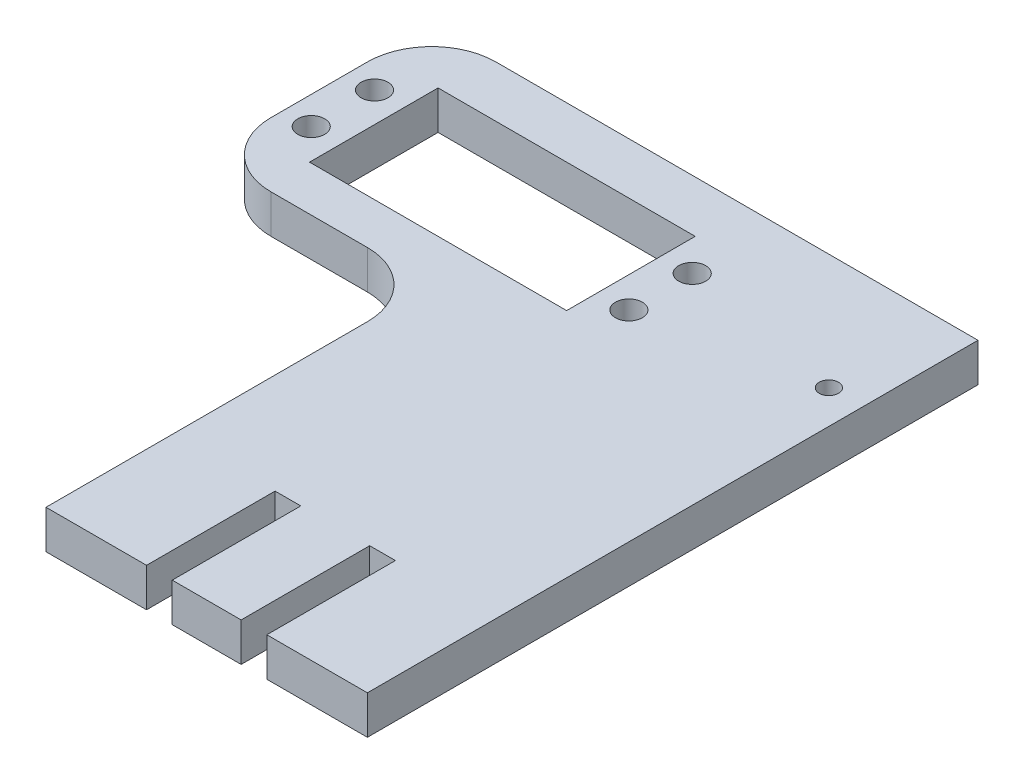
ISO-10303-21;
HEADER;
FILE_DESCRIPTION(('STEP AP214'),'2;1');
FILE_NAME('part.step','',(''),(''),'','','');
FILE_SCHEMA(('AUTOMOTIVE_DESIGN { 1 0 10303 214 1 1 1 1 }'));
ENDSEC;
DATA;
#1=APPLICATION_CONTEXT('core data for automotive mechanical design processes');
#2=APPLICATION_PROTOCOL_DEFINITION('international standard','automotive_design',2000,#1);
#3=PRODUCT_CONTEXT('',#1,'mechanical');
#4=PRODUCT('Part','Part','',(#3));
#5=PRODUCT_RELATED_PRODUCT_CATEGORY('part','',(#4));
#6=PRODUCT_DEFINITION_FORMATION('','',#4);
#7=PRODUCT_DEFINITION_CONTEXT('part definition',#1,'design');
#8=PRODUCT_DEFINITION('design','',#6,#7);
#9=PRODUCT_DEFINITION_SHAPE('','',#8);
#10=(LENGTH_UNIT() NAMED_UNIT(*) SI_UNIT(.MILLI.,.METRE.));
#11=(NAMED_UNIT(*) PLANE_ANGLE_UNIT() SI_UNIT($,.RADIAN.));
#12=(NAMED_UNIT(*) SI_UNIT($,.STERADIAN.) SOLID_ANGLE_UNIT());
#13=UNCERTAINTY_MEASURE_WITH_UNIT(LENGTH_MEASURE(1.E-05),#10,'distance_accuracy_value','');
#14=(GEOMETRIC_REPRESENTATION_CONTEXT(3) GLOBAL_UNCERTAINTY_ASSIGNED_CONTEXT((#13)) GLOBAL_UNIT_ASSIGNED_CONTEXT((#10,
#11,#12)) REPRESENTATION_CONTEXT('',''));
#15=CARTESIAN_POINT('',(0.,0.,0.));
#16=DIRECTION('',(0.,0.,1.));
#17=DIRECTION('',(1.,0.,0.));
#18=AXIS2_PLACEMENT_3D('',#15,#16,#17);
#19=CARTESIAN_POINT('',(0.,6.,47.5));
#20=DIRECTION('',(0.,0.,-1.));
#21=DIRECTION('',(-1.,0.,0.));
#22=AXIS2_PLACEMENT_3D('',#19,#20,#21);
#23=PLANE('',#22);
#24=DIRECTION('',(1.,0.,0.));
#25=VECTOR('',#24,1.);
#26=CARTESIAN_POINT('',(0.,0.,47.5));
#27=LINE('',#26,#25);
#28=CARTESIAN_POINT('',(-25.,0.,47.5));
#29=VERTEX_POINT('',#28);
#30=CARTESIAN_POINT('',(-9.36,0.,47.5));
#31=VERTEX_POINT('',#30);
#32=EDGE_CURVE('E283',#29,#31,#27,.T.);
#33=ORIENTED_EDGE('',*,*,#32,.T.);
#34=DIRECTION('',(0.,1.,0.));
#35=VECTOR('',#34,1.);
#36=CARTESIAN_POINT('',(-9.36,-3.99999999999999,47.5));
#37=LINE('',#36,#35);
#38=CARTESIAN_POINT('',(-9.36,6.,47.5));
#39=VERTEX_POINT('',#38);
#40=EDGE_CURVE('E229',#31,#39,#37,.T.);
#41=ORIENTED_EDGE('',*,*,#40,.T.);
#42=DIRECTION('',(1.,0.,0.));
#43=VECTOR('',#42,1.);
#44=CARTESIAN_POINT('',(0.,6.,47.5));
#45=LINE('',#44,#43);
#46=CARTESIAN_POINT('',(-25.,6.,47.5));
#47=VERTEX_POINT('',#46);
#48=EDGE_CURVE('E264',#47,#39,#45,.T.);
#49=ORIENTED_EDGE('',*,*,#48,.F.);
#50=DIRECTION('',(0.,-1.,0.));
#51=VECTOR('',#50,1.);
#52=CARTESIAN_POINT('',(-25.,6.,47.5));
#53=LINE('',#52,#51);
#54=EDGE_CURVE('E296',#47,#29,#53,.T.);
#55=ORIENTED_EDGE('',*,*,#54,.T.);
#56=EDGE_LOOP('',(#33,#41,#49,#55));
#57=FACE_BOUND('',#56,.T.);
#58=ADVANCED_FACE('F35',(#57),#23,.F.);
#59=CARTESIAN_POINT('',(9.36,6.,47.5));
#60=VERTEX_POINT('',#59);
#61=CARTESIAN_POINT('',(25.,6.,47.5));
#62=VERTEX_POINT('',#61);
#63=EDGE_CURVE('E263',#60,#62,#45,.T.);
#64=ORIENTED_EDGE('',*,*,#63,.F.);
#65=DIRECTION('',(0.,1.,0.));
#66=VECTOR('',#65,1.);
#67=CARTESIAN_POINT('',(9.36,-3.99999999999999,47.5));
#68=LINE('',#67,#66);
#69=CARTESIAN_POINT('',(9.36,0.,47.5));
#70=VERTEX_POINT('',#69);
#71=EDGE_CURVE('E247',#70,#60,#68,.T.);
#72=ORIENTED_EDGE('',*,*,#71,.F.);
#73=CARTESIAN_POINT('',(25.,0.,47.5));
#74=VERTEX_POINT('',#73);
#75=EDGE_CURVE('E282',#70,#74,#27,.T.);
#76=ORIENTED_EDGE('',*,*,#75,.T.);
#77=DIRECTION('',(0.,-1.,0.));
#78=VECTOR('',#77,1.);
#79=CARTESIAN_POINT('',(25.,6.,47.5));
#80=LINE('',#79,#78);
#81=EDGE_CURVE('E293',#62,#74,#80,.T.);
#82=ORIENTED_EDGE('',*,*,#81,.F.);
#83=EDGE_LOOP('',(#64,#72,#76,#82));
#84=FACE_BOUND('',#83,.T.);
#85=ADVANCED_FACE('F407',(#84),#23,.F.);
#86=CARTESIAN_POINT('',(-60.,6.,0.));
#87=DIRECTION('',(1.,0.,0.));
#88=DIRECTION('',(0.,0.,-1.));
#89=AXIS2_PLACEMENT_3D('',#86,#87,#88);
#90=PLANE('',#89);
#91=DIRECTION('',(0.,0.,1.));
#92=VECTOR('',#91,1.);
#93=CARTESIAN_POINT('',(-60.,6.,0.));
#94=LINE('',#93,#92);
#95=CARTESIAN_POINT('',(-60.,6.,-37.5));
#96=VERTEX_POINT('',#95);
#97=CARTESIAN_POINT('',(-60.,6.,-22.5));
#98=VERTEX_POINT('',#97);
#99=EDGE_CURVE('E253',#96,#98,#94,.T.);
#100=ORIENTED_EDGE('',*,*,#99,.F.);
#101=DIRECTION('',(0.,-1.,0.));
#102=VECTOR('',#101,1.);
#103=CARTESIAN_POINT('',(-60.,6.,-37.5));
#104=LINE('',#103,#102);
#105=CARTESIAN_POINT('',(-60.,0.,-37.5));
#106=VERTEX_POINT('',#105);
#107=EDGE_CURVE('E300',#96,#106,#104,.T.);
#108=ORIENTED_EDGE('',*,*,#107,.T.);
#109=DIRECTION('',(0.,0.,1.));
#110=VECTOR('',#109,1.);
#111=CARTESIAN_POINT('',(-60.,0.,0.));
#112=LINE('',#111,#110);
#113=CARTESIAN_POINT('',(-60.,0.,-22.5));
#114=VERTEX_POINT('',#113);
#115=EDGE_CURVE('E232',#106,#114,#112,.T.);
#116=ORIENTED_EDGE('',*,*,#115,.T.);
#117=DIRECTION('',(0.,-1.,0.));
#118=VECTOR('',#117,1.);
#119=CARTESIAN_POINT('',(-60.,6.,-22.5));
#120=LINE('',#119,#118);
#121=EDGE_CURVE('E298',#114,#98,#120,.F.);
#122=ORIENTED_EDGE('',*,*,#121,.T.);
#123=EDGE_LOOP('',(#100,#108,#116,#122));
#124=FACE_BOUND('',#123,.T.);
#125=ADVANCED_FACE('F371',(#124),#90,.F.);
#126=CARTESIAN_POINT('',(0.,6.,-12.5));
#127=DIRECTION('',(0.,0.,-1.));
#128=DIRECTION('',(-1.,0.,0.));
#129=AXIS2_PLACEMENT_3D('',#126,#127,#128);
#130=PLANE('',#129);
#131=DIRECTION('',(1.,0.,0.));
#132=VECTOR('',#131,1.);
#133=CARTESIAN_POINT('',(0.,6.,-12.5));
#134=LINE('',#133,#132);
#135=CARTESIAN_POINT('',(-50.,6.,-12.5));
#136=VERTEX_POINT('',#135);
#137=CARTESIAN_POINT('',(-35.,6.,-12.5));
#138=VERTEX_POINT('',#137);
#139=EDGE_CURVE('E256',#136,#138,#134,.T.);
#140=ORIENTED_EDGE('',*,*,#139,.F.);
#141=DIRECTION('',(0.,-1.,0.));
#142=VECTOR('',#141,1.);
#143=CARTESIAN_POINT('',(-50.,6.,-12.5));
#144=LINE('',#143,#142);
#145=CARTESIAN_POINT('',(-50.,0.,-12.5));
#146=VERTEX_POINT('',#145);
#147=EDGE_CURVE('E315',#136,#146,#144,.T.);
#148=ORIENTED_EDGE('',*,*,#147,.T.);
#149=DIRECTION('',(1.,0.,0.));
#150=VECTOR('',#149,1.);
#151=CARTESIAN_POINT('',(0.,0.,-12.5));
#152=LINE('',#151,#150);
#153=CARTESIAN_POINT('',(-35.,0.,-12.5));
#154=VERTEX_POINT('',#153);
#155=EDGE_CURVE('E276',#146,#154,#152,.T.);
#156=ORIENTED_EDGE('',*,*,#155,.T.);
#157=DIRECTION('',(0.,-1.,0.));
#158=VECTOR('',#157,1.);
#159=CARTESIAN_POINT('',(-35.,6.,-12.5));
#160=LINE('',#159,#158);
#161=EDGE_CURVE('E313',#154,#138,#160,.F.);
#162=ORIENTED_EDGE('',*,*,#161,.T.);
#163=EDGE_LOOP('',(#140,#148,#156,#162));
#164=FACE_BOUND('',#163,.T.);
#165=ADVANCED_FACE('F362',(#164),#130,.F.);
#166=CARTESIAN_POINT('',(-25.,6.,0.));
#167=DIRECTION('',(-1.,0.,0.));
#168=DIRECTION('',(0.,0.,1.));
#169=AXIS2_PLACEMENT_3D('',#166,#167,#168);
#170=PLANE('',#169);
#171=DIRECTION('',(0.,0.,-1.));
#172=VECTOR('',#171,1.);
#173=CARTESIAN_POINT('',(-25.,6.,0.));
#174=LINE('',#173,#172);
#175=CARTESIAN_POINT('',(-25.,6.,-2.50000000000001));
#176=VERTEX_POINT('',#175);
#177=EDGE_CURVE('E260',#47,#176,#174,.T.);
#178=ORIENTED_EDGE('',*,*,#177,.T.);
#179=DIRECTION('',(0.,-1.,0.));
#180=VECTOR('',#179,1.);
#181=CARTESIAN_POINT('',(-25.,6.,-2.50000000000001));
#182=LINE('',#181,#180);
#183=CARTESIAN_POINT('',(-25.,0.,-2.50000000000001));
#184=VERTEX_POINT('',#183);
#185=EDGE_CURVE('E318',#176,#184,#182,.T.);
#186=ORIENTED_EDGE('',*,*,#185,.T.);
#187=DIRECTION('',(0.,0.,-1.));
#188=VECTOR('',#187,1.);
#189=CARTESIAN_POINT('',(-25.,0.,0.));
#190=LINE('',#189,#188);
#191=EDGE_CURVE('E279',#29,#184,#190,.T.);
#192=ORIENTED_EDGE('',*,*,#191,.F.);
#193=ORIENTED_EDGE('',*,*,#54,.F.);
#194=EDGE_LOOP('',(#178,#186,#192,#193));
#195=FACE_BOUND('',#194,.T.);
#196=ADVANCED_FACE('F355',(#195),#170,.T.);
#197=CARTESIAN_POINT('',(-5.36,6.,47.5));
#198=VERTEX_POINT('',#197);
#199=CARTESIAN_POINT('',(5.36,6.,47.5));
#200=VERTEX_POINT('',#199);
#201=EDGE_CURVE('E268',#198,#200,#45,.T.);
#202=ORIENTED_EDGE('',*,*,#201,.F.);
#203=DIRECTION('',(0.,1.,0.));
#204=VECTOR('',#203,1.);
#205=CARTESIAN_POINT('',(-5.36,-3.99999999999999,47.5));
#206=LINE('',#205,#204);
#207=CARTESIAN_POINT('',(-5.36,0.,47.5));
#208=VERTEX_POINT('',#207);
#209=EDGE_CURVE('E228',#208,#198,#206,.T.);
#210=ORIENTED_EDGE('',*,*,#209,.F.);
#211=CARTESIAN_POINT('',(5.36,0.,47.5));
#212=VERTEX_POINT('',#211);
#213=EDGE_CURVE('E287',#208,#212,#27,.T.);
#214=ORIENTED_EDGE('',*,*,#213,.T.);
#215=DIRECTION('',(0.,1.,0.));
#216=VECTOR('',#215,1.);
#217=CARTESIAN_POINT('',(5.36,-3.99999999999999,47.5));
#218=LINE('',#217,#216);
#219=EDGE_CURVE('E249',#212,#200,#218,.T.);
#220=ORIENTED_EDGE('',*,*,#219,.T.);
#221=EDGE_LOOP('',(#202,#210,#214,#220));
#222=FACE_BOUND('',#221,.T.);
#223=ADVANCED_FACE('F394',(#222),#23,.F.);
#224=CARTESIAN_POINT('',(25.,6.,0.));
#225=DIRECTION('',(-1.,0.,0.));
#226=DIRECTION('',(0.,0.,1.));
#227=AXIS2_PLACEMENT_3D('',#224,#225,#226);
#228=PLANE('',#227);
#229=DIRECTION('',(0.,0.,-1.));
#230=VECTOR('',#229,1.);
#231=CARTESIAN_POINT('',(25.,0.,0.));
#232=LINE('',#231,#230);
#233=CARTESIAN_POINT('',(25.,0.,-47.5));
#234=VERTEX_POINT('',#233);
#235=EDGE_CURVE('E286',#74,#234,#232,.T.);
#236=ORIENTED_EDGE('',*,*,#235,.T.);
#237=DIRECTION('',(0.,-1.,0.));
#238=VECTOR('',#237,1.);
#239=CARTESIAN_POINT('',(25.,6.,-47.5));
#240=LINE('',#239,#238);
#241=CARTESIAN_POINT('',(25.,6.,-47.5));
#242=VERTEX_POINT('',#241);
#243=EDGE_CURVE('E273',#242,#234,#240,.T.);
#244=ORIENTED_EDGE('',*,*,#243,.F.);
#245=DIRECTION('',(0.,0.,-1.));
#246=VECTOR('',#245,1.);
#247=CARTESIAN_POINT('',(25.,6.,0.));
#248=LINE('',#247,#246);
#249=EDGE_CURVE('E267',#62,#242,#248,.T.);
#250=ORIENTED_EDGE('',*,*,#249,.F.);
#251=ORIENTED_EDGE('',*,*,#81,.T.);
#252=EDGE_LOOP('',(#236,#244,#250,#251));
#253=FACE_BOUND('',#252,.T.);
#254=ADVANCED_FACE('F385',(#253),#228,.F.);
#255=CARTESIAN_POINT('',(0.,6.,-47.5));
#256=DIRECTION('',(0.,0.,1.));
#257=DIRECTION('',(1.,0.,0.));
#258=AXIS2_PLACEMENT_3D('',#255,#256,#257);
#259=PLANE('',#258);
#260=DIRECTION('',(-1.,0.,0.));
#261=VECTOR('',#260,1.);
#262=CARTESIAN_POINT('',(0.,0.,-47.5));
#263=LINE('',#262,#261);
#264=CARTESIAN_POINT('',(-50.,0.,-47.5));
#265=VERTEX_POINT('',#264);
#266=EDGE_CURVE('E257',#234,#265,#263,.T.);
#267=ORIENTED_EDGE('',*,*,#266,.T.);
#268=DIRECTION('',(0.,-1.,0.));
#269=VECTOR('',#268,1.);
#270=CARTESIAN_POINT('',(-50.,6.,-47.5));
#271=LINE('',#270,#269);
#272=CARTESIAN_POINT('',(-50.,6.,-47.5));
#273=VERTEX_POINT('',#272);
#274=EDGE_CURVE('E307',#265,#273,#271,.F.);
#275=ORIENTED_EDGE('',*,*,#274,.T.);
#276=DIRECTION('',(-1.,0.,0.));
#277=VECTOR('',#276,1.);
#278=CARTESIAN_POINT('',(0.,6.,-47.5));
#279=LINE('',#278,#277);
#280=EDGE_CURVE('E270',#242,#273,#279,.T.);
#281=ORIENTED_EDGE('',*,*,#280,.F.);
#282=ORIENTED_EDGE('',*,*,#243,.T.);
#283=EDGE_LOOP('',(#267,#275,#281,#282));
#284=FACE_BOUND('',#283,.T.);
#285=ADVANCED_FACE('F380',(#284),#259,.F.);
#286=CARTESIAN_POINT('',(0.,6.,0.));
#287=DIRECTION('',(0.,1.,0.));
#288=DIRECTION('',(0.,0.,1.));
#289=AXIS2_PLACEMENT_3D('',#286,#287,#288);
#290=PLANE('',#289);
#291=CARTESIAN_POINT('',(-6.23885438200052,6.,-24.4249999999994));
#292=DIRECTION('',(0.,1.,0.));
#293=DIRECTION('',(0.,0.,1.));
#294=AXIS2_PLACEMENT_3D('',#291,#292,#293);
#295=CIRCLE('',#294,2.10000000000091);
#296=CARTESIAN_POINT('',(-6.23885438200052,6.,-22.3249999999985));
#297=VERTEX_POINT('',#296);
#298=EDGE_CURVE('E628',#297,#297,#295,.T.);
#299=ORIENTED_EDGE('',*,*,#298,.F.);
#300=EDGE_LOOP('',(#299));
#301=FACE_BOUND('',#300,.T.);
#302=CARTESIAN_POINT('',(-6.23885438200052,6.,-34.2749999999994));
#303=DIRECTION('',(0.,1.,0.));
#304=DIRECTION('',(0.,0.,1.));
#305=AXIS2_PLACEMENT_3D('',#302,#303,#304);
#306=CIRCLE('',#305,2.10000000000093);
#307=CARTESIAN_POINT('',(-6.23885438200052,6.,-32.1749999999985));
#308=VERTEX_POINT('',#307);
#309=EDGE_CURVE('E630',#308,#308,#306,.T.);
#310=ORIENTED_EDGE('',*,*,#309,.F.);
#311=EDGE_LOOP('',(#310));
#312=FACE_BOUND('',#311,.T.);
#313=CARTESIAN_POINT('',(-55.6611456180008,6.,-34.2749999999994));
#314=DIRECTION('',(0.,1.,0.));
#315=DIRECTION('',(0.,0.,1.));
#316=AXIS2_PLACEMENT_3D('',#313,#314,#315);
#317=CIRCLE('',#316,2.10000000000093);
#318=CARTESIAN_POINT('',(-55.6611456180008,6.,-32.1749999999985));
#319=VERTEX_POINT('',#318);
#320=EDGE_CURVE('E653',#319,#319,#317,.T.);
#321=ORIENTED_EDGE('',*,*,#320,.F.);
#322=EDGE_LOOP('',(#321));
#323=FACE_BOUND('',#322,.T.);
#324=CARTESIAN_POINT('',(-55.6611456180008,6.,-24.4249999999995));
#325=DIRECTION('',(0.,1.,0.));
#326=DIRECTION('',(0.,0.,1.));
#327=AXIS2_PLACEMENT_3D('',#324,#325,#326);
#328=CIRCLE('',#327,2.10000000000091);
#329=CARTESIAN_POINT('',(-55.6611456180008,6.,-22.3249999999985));
#330=VERTEX_POINT('',#329);
#331=EDGE_CURVE('E637',#330,#330,#328,.T.);
#332=ORIENTED_EDGE('',*,*,#331,.F.);
#333=EDGE_LOOP('',(#332));
#334=FACE_BOUND('',#333,.T.);
#335=CARTESIAN_POINT('',(19.8,6.,-29.5));
#336=DIRECTION('',(0.,-1.,0.));
#337=DIRECTION('',(0.,0.,-1.));
#338=AXIS2_PLACEMENT_3D('',#335,#336,#337);
#339=CIRCLE('',#338,1.5);
#340=CARTESIAN_POINT('',(19.8,6.,-31.));
#341=VERTEX_POINT('',#340);
#342=EDGE_CURVE('E209',#341,#341,#339,.T.);
#343=ORIENTED_EDGE('',*,*,#342,.T.);
#344=EDGE_LOOP('',(#343));
#345=FACE_BOUND('',#344,.T.);
#346=DIRECTION('',(0.,0.,-1.));
#347=VECTOR('',#346,1.);
#348=CARTESIAN_POINT('',(-11.,6.,-19.5));
#349=LINE('',#348,#347);
#350=CARTESIAN_POINT('',(-11.,6.,-19.5));
#351=VERTEX_POINT('',#350);
#352=CARTESIAN_POINT('',(-11.,6.,-39.5));
#353=VERTEX_POINT('',#352);
#354=EDGE_CURVE('E50',#351,#353,#349,.T.);
#355=ORIENTED_EDGE('',*,*,#354,.F.);
#356=DIRECTION('',(1.,0.,0.));
#357=VECTOR('',#356,1.);
#358=CARTESIAN_POINT('',(-51.,6.,-19.5));
#359=LINE('',#358,#357);
#360=CARTESIAN_POINT('',(-51.,6.,-19.5));
#361=VERTEX_POINT('',#360);
#362=EDGE_CURVE('E196',#361,#351,#359,.T.);
#363=ORIENTED_EDGE('',*,*,#362,.F.);
#364=DIRECTION('',(0.,0.,1.));
#365=VECTOR('',#364,1.);
#366=CARTESIAN_POINT('',(-51.,6.,-19.5));
#367=LINE('',#366,#365);
#368=CARTESIAN_POINT('',(-51.,6.,-39.5));
#369=VERTEX_POINT('',#368);
#370=EDGE_CURVE('E199',#369,#361,#367,.T.);
#371=ORIENTED_EDGE('',*,*,#370,.F.);
#372=DIRECTION('',(-1.,0.,0.));
#373=VECTOR('',#372,1.);
#374=CARTESIAN_POINT('',(-51.,6.,-39.5));
#375=LINE('',#374,#373);
#376=EDGE_CURVE('E208',#353,#369,#375,.T.);
#377=ORIENTED_EDGE('',*,*,#376,.F.);
#378=EDGE_LOOP('',(#355,#363,#371,#377));
#379=FACE_BOUND('',#378,.T.);
#380=DIRECTION('',(0.,0.,1.));
#381=VECTOR('',#380,1.);
#382=CARTESIAN_POINT('',(-9.36,6.,27.5));
#383=LINE('',#382,#381);
#384=CARTESIAN_POINT('',(-9.36,6.,27.5));
#385=VERTEX_POINT('',#384);
#386=EDGE_CURVE('E226',#385,#39,#383,.T.);
#387=ORIENTED_EDGE('',*,*,#386,.F.);
#388=DIRECTION('',(-1.,0.,0.));
#389=VECTOR('',#388,1.);
#390=CARTESIAN_POINT('',(-5.36,6.,27.5));
#391=LINE('',#390,#389);
#392=CARTESIAN_POINT('',(-5.36,6.,27.5));
#393=VERTEX_POINT('',#392);
#394=EDGE_CURVE('E222',#393,#385,#391,.T.);
#395=ORIENTED_EDGE('',*,*,#394,.F.);
#396=DIRECTION('',(0.,0.,-1.));
#397=VECTOR('',#396,1.);
#398=CARTESIAN_POINT('',(-5.36,6.,47.5));
#399=LINE('',#398,#397);
#400=EDGE_CURVE('E219',#198,#393,#399,.T.);
#401=ORIENTED_EDGE('',*,*,#400,.F.);
#402=ORIENTED_EDGE('',*,*,#201,.T.);
#403=DIRECTION('',(0.,0.,1.));
#404=VECTOR('',#403,1.);
#405=CARTESIAN_POINT('',(5.36,6.,47.5));
#406=LINE('',#405,#404);
#407=CARTESIAN_POINT('',(5.36,6.,27.5));
#408=VERTEX_POINT('',#407);
#409=EDGE_CURVE('E240',#408,#200,#406,.T.);
#410=ORIENTED_EDGE('',*,*,#409,.F.);
#411=DIRECTION('',(-1.,0.,0.));
#412=VECTOR('',#411,1.);
#413=CARTESIAN_POINT('',(5.36,6.,27.5));
#414=LINE('',#413,#412);
#415=CARTESIAN_POINT('',(9.36,6.,27.5));
#416=VERTEX_POINT('',#415);
#417=EDGE_CURVE('E215',#416,#408,#414,.T.);
#418=ORIENTED_EDGE('',*,*,#417,.F.);
#419=DIRECTION('',(0.,0.,-1.));
#420=VECTOR('',#419,1.);
#421=CARTESIAN_POINT('',(9.36,6.,27.5));
#422=LINE('',#421,#420);
#423=EDGE_CURVE('E242',#60,#416,#422,.T.);
#424=ORIENTED_EDGE('',*,*,#423,.F.);
#425=ORIENTED_EDGE('',*,*,#63,.T.);
#426=ORIENTED_EDGE('',*,*,#249,.T.);
#427=ORIENTED_EDGE('',*,*,#280,.T.);
#428=CARTESIAN_POINT('',(-50.,6.,-37.5));
#429=DIRECTION('',(0.,1.,0.));
#430=DIRECTION('',(0.,0.,1.));
#431=AXIS2_PLACEMENT_3D('',#428,#429,#430);
#432=CIRCLE('',#431,10.);
#433=EDGE_CURVE('E311',#273,#96,#432,.T.);
#434=ORIENTED_EDGE('',*,*,#433,.T.);
#435=ORIENTED_EDGE('',*,*,#99,.T.);
#436=CARTESIAN_POINT('',(-50.,6.,-22.5));
#437=DIRECTION('',(0.,1.,0.));
#438=DIRECTION('',(0.,0.,1.));
#439=AXIS2_PLACEMENT_3D('',#436,#437,#438);
#440=CIRCLE('',#439,10.);
#441=EDGE_CURVE('E309',#98,#136,#440,.T.);
#442=ORIENTED_EDGE('',*,*,#441,.T.);
#443=ORIENTED_EDGE('',*,*,#139,.T.);
#444=CARTESIAN_POINT('',(-35.,6.,-2.50000000000001));
#445=DIRECTION('',(0.,1.,0.));
#446=DIRECTION('',(0.,0.,1.));
#447=AXIS2_PLACEMENT_3D('',#444,#445,#446);
#448=CIRCLE('',#447,10.);
#449=EDGE_CURVE('E323',#138,#176,#448,.F.);
#450=ORIENTED_EDGE('',*,*,#449,.T.);
#451=ORIENTED_EDGE('',*,*,#177,.F.);
#452=ORIENTED_EDGE('',*,*,#48,.T.);
#453=EDGE_LOOP('',(#387,#395,#401,#402,#410,#418,#424,#425,#426,#427,#434,#435,#442,#443,#450,
#451,#452));
#454=FACE_BOUND('',#453,.T.);
#455=ADVANCED_FACE('F351',(#301,#312,#323,#334,#345,#379,#454),#290,.T.);
#456=CARTESIAN_POINT('',(0.,0.,0.));
#457=DIRECTION('',(0.,1.,0.));
#458=DIRECTION('',(0.,0.,1.));
#459=AXIS2_PLACEMENT_3D('',#456,#457,#458);
#460=PLANE('',#459);
#461=CARTESIAN_POINT('',(-6.23885438200052,0.,-24.4249999999994));
#462=DIRECTION('',(0.,1.,0.));
#463=DIRECTION('',(0.,0.,1.));
#464=AXIS2_PLACEMENT_3D('',#461,#462,#463);
#465=CIRCLE('',#464,2.10000000000091);
#466=CARTESIAN_POINT('',(-6.23885438200052,0.,-22.3249999999985));
#467=VERTEX_POINT('',#466);
#468=EDGE_CURVE('E625',#467,#467,#465,.T.);
#469=ORIENTED_EDGE('',*,*,#468,.T.);
#470=EDGE_LOOP('',(#469));
#471=FACE_BOUND('',#470,.T.);
#472=CARTESIAN_POINT('',(-6.23885438200052,0.,-34.2749999999994));
#473=DIRECTION('',(0.,1.,0.));
#474=DIRECTION('',(0.,0.,1.));
#475=AXIS2_PLACEMENT_3D('',#472,#473,#474);
#476=CIRCLE('',#475,2.10000000000093);
#477=CARTESIAN_POINT('',(-6.23885438200052,0.,-32.1749999999985));
#478=VERTEX_POINT('',#477);
#479=EDGE_CURVE('E658',#478,#478,#476,.T.);
#480=ORIENTED_EDGE('',*,*,#479,.T.);
#481=EDGE_LOOP('',(#480));
#482=FACE_BOUND('',#481,.T.);
#483=CARTESIAN_POINT('',(-55.6611456180008,0.,-34.2749999999994));
#484=DIRECTION('',(0.,1.,0.));
#485=DIRECTION('',(0.,0.,1.));
#486=AXIS2_PLACEMENT_3D('',#483,#484,#485);
#487=CIRCLE('',#486,2.10000000000093);
#488=CARTESIAN_POINT('',(-55.6611456180008,0.,-32.1749999999985));
#489=VERTEX_POINT('',#488);
#490=EDGE_CURVE('E639',#489,#489,#487,.T.);
#491=ORIENTED_EDGE('',*,*,#490,.T.);
#492=EDGE_LOOP('',(#491));
#493=FACE_BOUND('',#492,.T.);
#494=CARTESIAN_POINT('',(-55.6611456180008,0.,-24.4249999999995));
#495=DIRECTION('',(0.,1.,0.));
#496=DIRECTION('',(0.,0.,1.));
#497=AXIS2_PLACEMENT_3D('',#494,#495,#496);
#498=CIRCLE('',#497,2.10000000000091);
#499=CARTESIAN_POINT('',(-55.6611456180008,0.,-22.3249999999985));
#500=VERTEX_POINT('',#499);
#501=EDGE_CURVE('E634',#500,#500,#498,.T.);
#502=ORIENTED_EDGE('',*,*,#501,.T.);
#503=EDGE_LOOP('',(#502));
#504=FACE_BOUND('',#503,.T.);
#505=CARTESIAN_POINT('',(19.8,0.,-29.5));
#506=DIRECTION('',(0.,-1.,0.));
#507=DIRECTION('',(0.,0.,-1.));
#508=AXIS2_PLACEMENT_3D('',#505,#506,#507);
#509=CIRCLE('',#508,1.5);
#510=CARTESIAN_POINT('',(19.8,0.,-31.));
#511=VERTEX_POINT('',#510);
#512=EDGE_CURVE('E202',#511,#511,#509,.T.);
#513=ORIENTED_EDGE('',*,*,#512,.F.);
#514=EDGE_LOOP('',(#513));
#515=FACE_BOUND('',#514,.T.);
#516=DIRECTION('',(1.,0.,0.));
#517=VECTOR('',#516,1.);
#518=CARTESIAN_POINT('',(-51.,0.,-19.5));
#519=LINE('',#518,#517);
#520=CARTESIAN_POINT('',(-51.,0.,-19.5));
#521=VERTEX_POINT('',#520);
#522=CARTESIAN_POINT('',(-11.,0.,-19.5));
#523=VERTEX_POINT('',#522);
#524=EDGE_CURVE('E186',#521,#523,#519,.T.);
#525=ORIENTED_EDGE('',*,*,#524,.T.);
#526=DIRECTION('',(0.,0.,-1.));
#527=VECTOR('',#526,1.);
#528=CARTESIAN_POINT('',(-11.,0.,-19.5));
#529=LINE('',#528,#527);
#530=CARTESIAN_POINT('',(-11.,0.,-39.5));
#531=VERTEX_POINT('',#530);
#532=EDGE_CURVE('E180',#523,#531,#529,.T.);
#533=ORIENTED_EDGE('',*,*,#532,.T.);
#534=DIRECTION('',(-1.,0.,0.));
#535=VECTOR('',#534,1.);
#536=CARTESIAN_POINT('',(-51.,0.,-39.5));
#537=LINE('',#536,#535);
#538=CARTESIAN_POINT('',(-51.,0.,-39.5));
#539=VERTEX_POINT('',#538);
#540=EDGE_CURVE('E189',#531,#539,#537,.T.);
#541=ORIENTED_EDGE('',*,*,#540,.T.);
#542=DIRECTION('',(0.,0.,1.));
#543=VECTOR('',#542,1.);
#544=CARTESIAN_POINT('',(-51.,0.,-19.5));
#545=LINE('',#544,#543);
#546=EDGE_CURVE('E58',#539,#521,#545,.T.);
#547=ORIENTED_EDGE('',*,*,#546,.T.);
#548=EDGE_LOOP('',(#525,#533,#541,#547));
#549=FACE_BOUND('',#548,.T.);
#550=DIRECTION('',(-1.,0.,0.));
#551=VECTOR('',#550,1.);
#552=CARTESIAN_POINT('',(0.,0.,27.5));
#553=LINE('',#552,#551);
#554=CARTESIAN_POINT('',(-5.36,0.,27.5));
#555=VERTEX_POINT('',#554);
#556=CARTESIAN_POINT('',(-9.36,0.,27.5));
#557=VERTEX_POINT('',#556);
#558=EDGE_CURVE('E43',#555,#557,#553,.T.);
#559=ORIENTED_EDGE('',*,*,#558,.T.);
#560=DIRECTION('',(0.,0.,1.));
#561=VECTOR('',#560,1.);
#562=CARTESIAN_POINT('',(-9.36,0.,0.));
#563=LINE('',#562,#561);
#564=EDGE_CURVE('E11',#557,#31,#563,.T.);
#565=ORIENTED_EDGE('',*,*,#564,.T.);
#566=ORIENTED_EDGE('',*,*,#32,.F.);
#567=ORIENTED_EDGE('',*,*,#191,.T.);
#568=CARTESIAN_POINT('',(-35.,0.,-2.50000000000001));
#569=DIRECTION('',(0.,1.,0.));
#570=DIRECTION('',(0.,0.,1.));
#571=AXIS2_PLACEMENT_3D('',#568,#569,#570);
#572=CIRCLE('',#571,10.);
#573=EDGE_CURVE('E321',#184,#154,#572,.T.);
#574=ORIENTED_EDGE('',*,*,#573,.T.);
#575=ORIENTED_EDGE('',*,*,#155,.F.);
#576=CARTESIAN_POINT('',(-50.,0.,-22.5));
#577=DIRECTION('',(0.,1.,0.));
#578=DIRECTION('',(0.,0.,1.));
#579=AXIS2_PLACEMENT_3D('',#576,#577,#578);
#580=CIRCLE('',#579,10.);
#581=EDGE_CURVE('E303',#146,#114,#580,.F.);
#582=ORIENTED_EDGE('',*,*,#581,.T.);
#583=ORIENTED_EDGE('',*,*,#115,.F.);
#584=CARTESIAN_POINT('',(-50.,0.,-37.5));
#585=DIRECTION('',(0.,1.,0.));
#586=DIRECTION('',(0.,0.,1.));
#587=AXIS2_PLACEMENT_3D('',#584,#585,#586);
#588=CIRCLE('',#587,10.);
#589=EDGE_CURVE('E305',#106,#265,#588,.F.);
#590=ORIENTED_EDGE('',*,*,#589,.T.);
#591=ORIENTED_EDGE('',*,*,#266,.F.);
#592=ORIENTED_EDGE('',*,*,#235,.F.);
#593=ORIENTED_EDGE('',*,*,#75,.F.);
#594=DIRECTION('',(0.,0.,-1.));
#595=VECTOR('',#594,1.);
#596=CARTESIAN_POINT('',(9.36,0.,0.));
#597=LINE('',#596,#595);
#598=CARTESIAN_POINT('',(9.36,0.,27.5));
#599=VERTEX_POINT('',#598);
#600=EDGE_CURVE('E331',#70,#599,#597,.T.);
#601=ORIENTED_EDGE('',*,*,#600,.T.);
#602=DIRECTION('',(-1.,0.,0.));
#603=VECTOR('',#602,1.);
#604=CARTESIAN_POINT('',(0.,0.,27.5));
#605=LINE('',#604,#603);
#606=CARTESIAN_POINT('',(5.36,0.,27.5));
#607=VERTEX_POINT('',#606);
#608=EDGE_CURVE('E328',#599,#607,#605,.T.);
#609=ORIENTED_EDGE('',*,*,#608,.T.);
#610=DIRECTION('',(0.,0.,1.));
#611=VECTOR('',#610,1.);
#612=CARTESIAN_POINT('',(5.36,0.,0.));
#613=LINE('',#612,#611);
#614=EDGE_CURVE('E325',#607,#212,#613,.T.);
#615=ORIENTED_EDGE('',*,*,#614,.T.);
#616=ORIENTED_EDGE('',*,*,#213,.F.);
#617=DIRECTION('',(0.,0.,-1.));
#618=VECTOR('',#617,1.);
#619=CARTESIAN_POINT('',(-5.36,0.,0.));
#620=LINE('',#619,#618);
#621=EDGE_CURVE('E334',#208,#555,#620,.T.);
#622=ORIENTED_EDGE('',*,*,#621,.T.);
#623=EDGE_LOOP('',(#559,#565,#566,#567,#574,#575,#582,#583,#590,#591,#592,#593,#601,#609,#615,
#616,#622));
#624=FACE_BOUND('',#623,.T.);
#625=ADVANCED_FACE('F193',(#471,#482,#493,#504,#515,#549,#624),#460,.F.);
#626=CARTESIAN_POINT('',(-50.,6.,-37.5));
#627=DIRECTION('',(0.,-1.,0.));
#628=DIRECTION('',(0.,0.,-1.));
#629=AXIS2_PLACEMENT_3D('',#626,#627,#628);
#630=CYLINDRICAL_SURFACE('',#629,10.);
#631=ORIENTED_EDGE('',*,*,#433,.F.);
#632=ORIENTED_EDGE('',*,*,#274,.F.);
#633=ORIENTED_EDGE('',*,*,#589,.F.);
#634=ORIENTED_EDGE('',*,*,#107,.F.);
#635=EDGE_LOOP('',(#631,#632,#633,#634));
#636=FACE_BOUND('',#635,.T.);
#637=ADVANCED_FACE('F375',(#636),#630,.T.);
#638=CARTESIAN_POINT('',(-50.,6.,-22.5));
#639=DIRECTION('',(0.,-1.,0.));
#640=DIRECTION('',(0.,0.,-1.));
#641=AXIS2_PLACEMENT_3D('',#638,#639,#640);
#642=CYLINDRICAL_SURFACE('',#641,10.);
#643=ORIENTED_EDGE('',*,*,#441,.F.);
#644=ORIENTED_EDGE('',*,*,#121,.F.);
#645=ORIENTED_EDGE('',*,*,#581,.F.);
#646=ORIENTED_EDGE('',*,*,#147,.F.);
#647=EDGE_LOOP('',(#643,#644,#645,#646));
#648=FACE_BOUND('',#647,.T.);
#649=ADVANCED_FACE('F366',(#648),#642,.T.);
#650=CARTESIAN_POINT('',(-35.,6.,-2.50000000000001));
#651=DIRECTION('',(0.,-1.,0.));
#652=DIRECTION('',(0.,0.,-1.));
#653=AXIS2_PLACEMENT_3D('',#650,#651,#652);
#654=CYLINDRICAL_SURFACE('',#653,10.);
#655=ORIENTED_EDGE('',*,*,#449,.F.);
#656=ORIENTED_EDGE('',*,*,#161,.F.);
#657=ORIENTED_EDGE('',*,*,#573,.F.);
#658=ORIENTED_EDGE('',*,*,#185,.F.);
#659=EDGE_LOOP('',(#655,#656,#657,#658));
#660=FACE_BOUND('',#659,.T.);
#661=ADVANCED_FACE('F37',(#660),#654,.F.);
#662=CARTESIAN_POINT('',(5.36,-3.99999999999999,27.5));
#663=DIRECTION('',(0.,0.,-1.));
#664=DIRECTION('',(-1.,0.,0.));
#665=AXIS2_PLACEMENT_3D('',#662,#663,#664);
#666=PLANE('',#665);
#667=DIRECTION('',(0.,1.,0.));
#668=VECTOR('',#667,1.);
#669=CARTESIAN_POINT('',(9.36,-3.99999999999999,27.5));
#670=LINE('',#669,#668);
#671=EDGE_CURVE('E223',#599,#416,#670,.T.);
#672=ORIENTED_EDGE('',*,*,#671,.T.);
#673=ORIENTED_EDGE('',*,*,#417,.T.);
#674=DIRECTION('',(0.,1.,0.));
#675=VECTOR('',#674,1.);
#676=CARTESIAN_POINT('',(5.36,-3.99999999999999,27.5));
#677=LINE('',#676,#675);
#678=EDGE_CURVE('E245',#607,#408,#677,.T.);
#679=ORIENTED_EDGE('',*,*,#678,.F.);
#680=ORIENTED_EDGE('',*,*,#608,.F.);
#681=EDGE_LOOP('',(#672,#673,#679,#680));
#682=FACE_BOUND('',#681,.T.);
#683=ADVANCED_FACE('F400',(#682),#666,.F.);
#684=CARTESIAN_POINT('',(9.36,-3.99999999999999,27.5));
#685=DIRECTION('',(1.,0.,0.));
#686=DIRECTION('',(0.,0.,-1.));
#687=AXIS2_PLACEMENT_3D('',#684,#685,#686);
#688=PLANE('',#687);
#689=ORIENTED_EDGE('',*,*,#71,.T.);
#690=ORIENTED_EDGE('',*,*,#423,.T.);
#691=ORIENTED_EDGE('',*,*,#671,.F.);
#692=ORIENTED_EDGE('',*,*,#600,.F.);
#693=EDGE_LOOP('',(#689,#690,#691,#692));
#694=FACE_BOUND('',#693,.T.);
#695=ADVANCED_FACE('F437',(#694),#688,.F.);
#696=CARTESIAN_POINT('',(5.36,-3.99999999999999,47.5));
#697=DIRECTION('',(-1.,0.,0.));
#698=DIRECTION('',(0.,0.,1.));
#699=AXIS2_PLACEMENT_3D('',#696,#697,#698);
#700=PLANE('',#699);
#701=ORIENTED_EDGE('',*,*,#678,.T.);
#702=ORIENTED_EDGE('',*,*,#409,.T.);
#703=ORIENTED_EDGE('',*,*,#219,.F.);
#704=ORIENTED_EDGE('',*,*,#614,.F.);
#705=EDGE_LOOP('',(#701,#702,#703,#704));
#706=FACE_BOUND('',#705,.T.);
#707=ADVANCED_FACE('F398',(#706),#700,.F.);
#708=CARTESIAN_POINT('',(-9.36,-3.99999999999999,27.5));
#709=DIRECTION('',(-1.,0.,0.));
#710=DIRECTION('',(0.,0.,1.));
#711=AXIS2_PLACEMENT_3D('',#708,#709,#710);
#712=PLANE('',#711);
#713=DIRECTION('',(0.,1.,0.));
#714=VECTOR('',#713,1.);
#715=CARTESIAN_POINT('',(-9.36,-3.99999999999999,27.5));
#716=LINE('',#715,#714);
#717=EDGE_CURVE('E233',#557,#385,#716,.T.);
#718=ORIENTED_EDGE('',*,*,#717,.T.);
#719=ORIENTED_EDGE('',*,*,#386,.T.);
#720=ORIENTED_EDGE('',*,*,#40,.F.);
#721=ORIENTED_EDGE('',*,*,#564,.F.);
#722=EDGE_LOOP('',(#718,#719,#720,#721));
#723=FACE_BOUND('',#722,.T.);
#724=ADVANCED_FACE('F346',(#723),#712,.F.);
#725=CARTESIAN_POINT('',(-5.36,-3.99999999999999,27.5));
#726=DIRECTION('',(0.,0.,-1.));
#727=DIRECTION('',(-1.,0.,0.));
#728=AXIS2_PLACEMENT_3D('',#725,#726,#727);
#729=PLANE('',#728);
#730=DIRECTION('',(0.,1.,0.));
#731=VECTOR('',#730,1.);
#732=CARTESIAN_POINT('',(-5.36,-3.99999999999999,27.5));
#733=LINE('',#732,#731);
#734=EDGE_CURVE('E235',#555,#393,#733,.T.);
#735=ORIENTED_EDGE('',*,*,#734,.T.);
#736=ORIENTED_EDGE('',*,*,#394,.T.);
#737=ORIENTED_EDGE('',*,*,#717,.F.);
#738=ORIENTED_EDGE('',*,*,#558,.F.);
#739=EDGE_LOOP('',(#735,#736,#737,#738));
#740=FACE_BOUND('',#739,.T.);
#741=ADVANCED_FACE('F342',(#740),#729,.F.);
#742=CARTESIAN_POINT('',(-5.36,-3.99999999999999,47.5));
#743=DIRECTION('',(1.,0.,0.));
#744=DIRECTION('',(0.,0.,-1.));
#745=AXIS2_PLACEMENT_3D('',#742,#743,#744);
#746=PLANE('',#745);
#747=ORIENTED_EDGE('',*,*,#209,.T.);
#748=ORIENTED_EDGE('',*,*,#400,.T.);
#749=ORIENTED_EDGE('',*,*,#734,.F.);
#750=ORIENTED_EDGE('',*,*,#621,.F.);
#751=EDGE_LOOP('',(#747,#748,#749,#750));
#752=FACE_BOUND('',#751,.T.);
#753=ADVANCED_FACE('F524',(#752),#746,.F.);
#754=CARTESIAN_POINT('',(-11.,0.,-19.5));
#755=DIRECTION('',(1.,0.,0.));
#756=DIRECTION('',(0.,0.,-1.));
#757=AXIS2_PLACEMENT_3D('',#754,#755,#756);
#758=PLANE('',#757);
#759=ORIENTED_EDGE('',*,*,#354,.T.);
#760=DIRECTION('',(0.,1.,0.));
#761=VECTOR('',#760,1.);
#762=CARTESIAN_POINT('',(-11.,0.,-39.5));
#763=LINE('',#762,#761);
#764=EDGE_CURVE('E176',#531,#353,#763,.T.);
#765=ORIENTED_EDGE('',*,*,#764,.F.);
#766=ORIENTED_EDGE('',*,*,#532,.F.);
#767=DIRECTION('',(0.,1.,0.));
#768=VECTOR('',#767,1.);
#769=CARTESIAN_POINT('',(-11.,0.,-19.5));
#770=LINE('',#769,#768);
#771=EDGE_CURVE('E213',#523,#351,#770,.T.);
#772=ORIENTED_EDGE('',*,*,#771,.T.);
#773=EDGE_LOOP('',(#759,#765,#766,#772));
#774=FACE_BOUND('',#773,.T.);
#775=ADVANCED_FACE('F178',(#774),#758,.F.);
#776=CARTESIAN_POINT('',(-51.,0.,-19.5));
#777=DIRECTION('',(0.,0.,1.));
#778=DIRECTION('',(1.,0.,0.));
#779=AXIS2_PLACEMENT_3D('',#776,#777,#778);
#780=PLANE('',#779);
#781=ORIENTED_EDGE('',*,*,#362,.T.);
#782=ORIENTED_EDGE('',*,*,#771,.F.);
#783=ORIENTED_EDGE('',*,*,#524,.F.);
#784=DIRECTION('',(0.,1.,0.));
#785=VECTOR('',#784,1.);
#786=CARTESIAN_POINT('',(-51.,0.,-19.5));
#787=LINE('',#786,#785);
#788=EDGE_CURVE('E216',#521,#361,#787,.T.);
#789=ORIENTED_EDGE('',*,*,#788,.T.);
#790=EDGE_LOOP('',(#781,#782,#783,#789));
#791=FACE_BOUND('',#790,.T.);
#792=ADVANCED_FACE('F540',(#791),#780,.F.);
#793=CARTESIAN_POINT('',(-51.,0.,-19.5));
#794=DIRECTION('',(-1.,0.,0.));
#795=DIRECTION('',(0.,0.,1.));
#796=AXIS2_PLACEMENT_3D('',#793,#794,#795);
#797=PLANE('',#796);
#798=ORIENTED_EDGE('',*,*,#370,.T.);
#799=ORIENTED_EDGE('',*,*,#788,.F.);
#800=ORIENTED_EDGE('',*,*,#546,.F.);
#801=DIRECTION('',(0.,1.,0.));
#802=VECTOR('',#801,1.);
#803=CARTESIAN_POINT('',(-51.,0.,-39.5));
#804=LINE('',#803,#802);
#805=EDGE_CURVE('E185',#539,#369,#804,.T.);
#806=ORIENTED_EDGE('',*,*,#805,.T.);
#807=EDGE_LOOP('',(#798,#799,#800,#806));
#808=FACE_BOUND('',#807,.T.);
#809=ADVANCED_FACE('F548',(#808),#797,.F.);
#810=CARTESIAN_POINT('',(-51.,0.,-39.5));
#811=DIRECTION('',(0.,0.,-1.));
#812=DIRECTION('',(-1.,0.,0.));
#813=AXIS2_PLACEMENT_3D('',#810,#811,#812);
#814=PLANE('',#813);
#815=ORIENTED_EDGE('',*,*,#376,.T.);
#816=ORIENTED_EDGE('',*,*,#805,.F.);
#817=ORIENTED_EDGE('',*,*,#540,.F.);
#818=ORIENTED_EDGE('',*,*,#764,.T.);
#819=EDGE_LOOP('',(#815,#816,#817,#818));
#820=FACE_BOUND('',#819,.T.);
#821=ADVANCED_FACE('F190',(#820),#814,.F.);
#822=CARTESIAN_POINT('',(19.8,6.,-29.5));
#823=DIRECTION('',(0.,-1.,0.));
#824=DIRECTION('',(0.,0.,-1.));
#825=AXIS2_PLACEMENT_3D('',#822,#823,#824);
#826=CYLINDRICAL_SURFACE('',#825,1.5);
#827=ORIENTED_EDGE('',*,*,#342,.F.);
#828=EDGE_LOOP('',(#827));
#829=FACE_BOUND('',#828,.T.);
#830=ORIENTED_EDGE('',*,*,#512,.T.);
#831=EDGE_LOOP('',(#830));
#832=FACE_BOUND('',#831,.T.);
#833=ADVANCED_FACE('F564',(#829,#832),#826,.F.);
#834=CARTESIAN_POINT('',(-55.6611456180008,0.,-24.4249999999995));
#835=DIRECTION('',(0.,1.,0.));
#836=DIRECTION('',(0.,0.,1.));
#837=AXIS2_PLACEMENT_3D('',#834,#835,#836);
#838=CYLINDRICAL_SURFACE('',#837,2.10000000000091);
#839=ORIENTED_EDGE('',*,*,#501,.F.);
#840=EDGE_LOOP('',(#839));
#841=FACE_BOUND('',#840,.T.);
#842=ORIENTED_EDGE('',*,*,#331,.T.);
#843=EDGE_LOOP('',(#842));
#844=FACE_BOUND('',#843,.T.);
#845=ADVANCED_FACE('F571',(#841,#844),#838,.F.);
#846=CARTESIAN_POINT('',(-55.6611456180008,0.,-34.2749999999994));
#847=DIRECTION('',(0.,1.,0.));
#848=DIRECTION('',(0.,0.,1.));
#849=AXIS2_PLACEMENT_3D('',#846,#847,#848);
#850=CYLINDRICAL_SURFACE('',#849,2.10000000000093);
#851=ORIENTED_EDGE('',*,*,#490,.F.);
#852=EDGE_LOOP('',(#851));
#853=FACE_BOUND('',#852,.T.);
#854=ORIENTED_EDGE('',*,*,#320,.T.);
#855=EDGE_LOOP('',(#854));
#856=FACE_BOUND('',#855,.T.);
#857=ADVANCED_FACE('F579',(#853,#856),#850,.F.);
#858=CARTESIAN_POINT('',(-6.23885438200052,0.,-34.2749999999994));
#859=DIRECTION('',(0.,1.,0.));
#860=DIRECTION('',(0.,0.,1.));
#861=AXIS2_PLACEMENT_3D('',#858,#859,#860);
#862=CYLINDRICAL_SURFACE('',#861,2.10000000000093);
#863=ORIENTED_EDGE('',*,*,#479,.F.);
#864=EDGE_LOOP('',(#863));
#865=FACE_BOUND('',#864,.T.);
#866=ORIENTED_EDGE('',*,*,#309,.T.);
#867=EDGE_LOOP('',(#866));
#868=FACE_BOUND('',#867,.T.);
#869=ADVANCED_FACE('F588',(#865,#868),#862,.F.);
#870=CARTESIAN_POINT('',(-6.23885438200052,0.,-24.4249999999994));
#871=DIRECTION('',(0.,1.,0.));
#872=DIRECTION('',(0.,0.,1.));
#873=AXIS2_PLACEMENT_3D('',#870,#871,#872);
#874=CYLINDRICAL_SURFACE('',#873,2.10000000000091);
#875=ORIENTED_EDGE('',*,*,#468,.F.);
#876=EDGE_LOOP('',(#875));
#877=FACE_BOUND('',#876,.T.);
#878=ORIENTED_EDGE('',*,*,#298,.T.);
#879=EDGE_LOOP('',(#878));
#880=FACE_BOUND('',#879,.T.);
#881=ADVANCED_FACE('F597',(#877,#880),#874,.F.);
#882=CLOSED_SHELL('',(#58,#85,#125,#165,#196,#223,#254,#285,#455,#625,#637,#649,#661,#683,#695,
#707,#724,#741,#753,#775,#792,#809,#821,#833,#845,#857,#869,#881));
#883=MANIFOLD_SOLID_BREP('B2',#882);
#884=ADVANCED_BREP_SHAPE_REPRESENTATION('',(#18,#883),#14);
#885=SHAPE_DEFINITION_REPRESENTATION(#9,#884);
ENDSEC;
END-ISO-10303-21;
